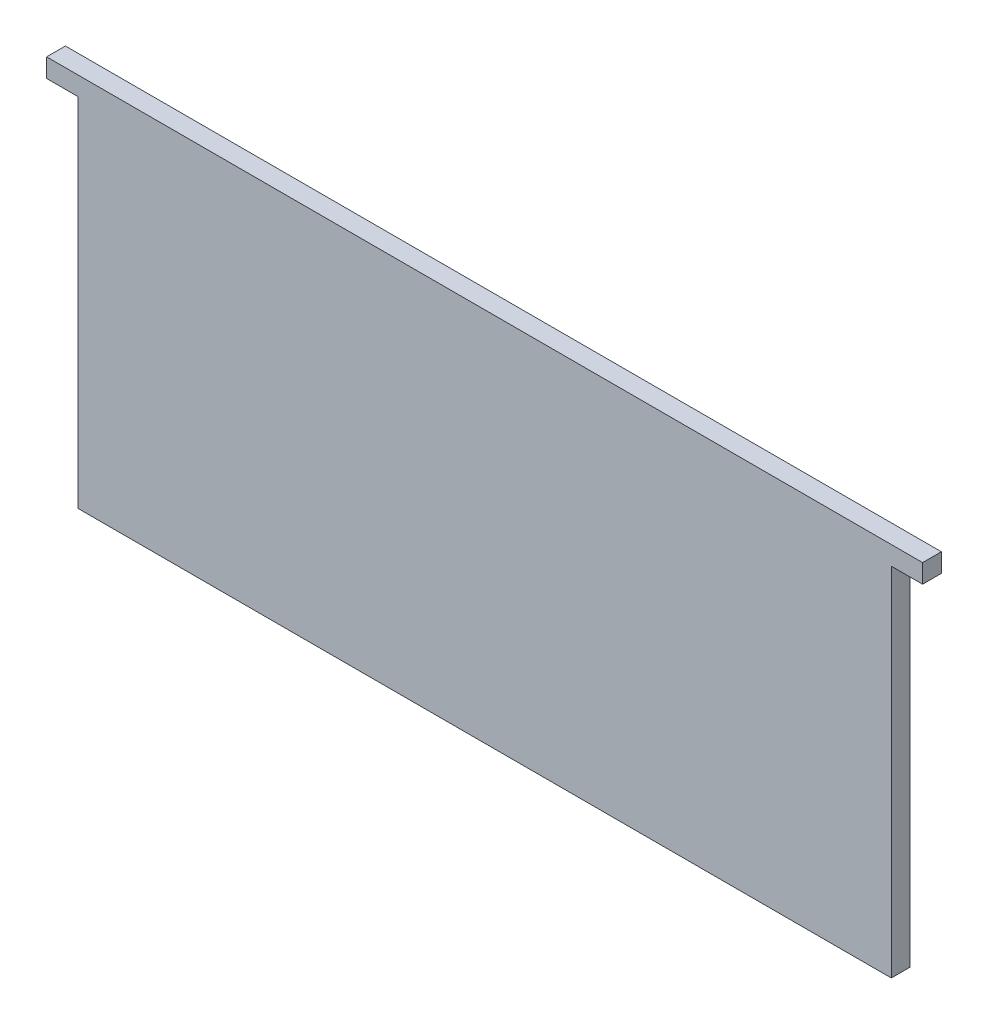
ISO-10303-21;
HEADER;
FILE_DESCRIPTION(('STEP AP214'),'2;1');
FILE_NAME('part.step','',(''),(''),'','','');
FILE_SCHEMA(('AUTOMOTIVE_DESIGN { 1 0 10303 214 1 1 1 1 }'));
ENDSEC;
DATA;
#1=APPLICATION_CONTEXT('core data for automotive mechanical design processes');
#2=APPLICATION_PROTOCOL_DEFINITION('international standard','automotive_design',2000,#1);
#3=PRODUCT_CONTEXT('',#1,'mechanical');
#4=PRODUCT('Part','Part','',(#3));
#5=PRODUCT_RELATED_PRODUCT_CATEGORY('part','',(#4));
#6=PRODUCT_DEFINITION_FORMATION('','',#4);
#7=PRODUCT_DEFINITION_CONTEXT('part definition',#1,'design');
#8=PRODUCT_DEFINITION('design','',#6,#7);
#9=PRODUCT_DEFINITION_SHAPE('','',#8);
#10=(LENGTH_UNIT() NAMED_UNIT(*) SI_UNIT(.MILLI.,.METRE.));
#11=(NAMED_UNIT(*) PLANE_ANGLE_UNIT() SI_UNIT($,.RADIAN.));
#12=(NAMED_UNIT(*) SI_UNIT($,.STERADIAN.) SOLID_ANGLE_UNIT());
#13=UNCERTAINTY_MEASURE_WITH_UNIT(LENGTH_MEASURE(1.E-05),#10,'distance_accuracy_value','');
#14=(GEOMETRIC_REPRESENTATION_CONTEXT(3) GLOBAL_UNCERTAINTY_ASSIGNED_CONTEXT((#13)) GLOBAL_UNIT_ASSIGNED_CONTEXT((#10,
#11,#12)) REPRESENTATION_CONTEXT('',''));
#15=CARTESIAN_POINT('',(0.,0.,0.));
#16=DIRECTION('',(0.,0.,1.));
#17=DIRECTION('',(1.,0.,0.));
#18=AXIS2_PLACEMENT_3D('',#15,#16,#17);
#19=CARTESIAN_POINT('',(-65.,0.,3.));
#20=DIRECTION('',(-1.,0.,0.));
#21=DIRECTION('',(0.,0.,1.));
#22=AXIS2_PLACEMENT_3D('',#19,#20,#21);
#23=PLANE('',#22);
#24=DIRECTION('',(0.,1.,0.));
#25=VECTOR('',#24,1.);
#26=CARTESIAN_POINT('',(-65.,0.,0.));
#27=LINE('',#26,#25);
#28=CARTESIAN_POINT('',(-65.,-30.,0.));
#29=VERTEX_POINT('',#28);
#30=CARTESIAN_POINT('',(-65.,27.,0.));
#31=VERTEX_POINT('',#30);
#32=EDGE_CURVE('E130',#29,#31,#27,.T.);
#33=ORIENTED_EDGE('',*,*,#32,.F.);
#34=DIRECTION('',(0.,0.,-1.));
#35=VECTOR('',#34,1.);
#36=CARTESIAN_POINT('',(-65.,-30.,3.));
#37=LINE('',#36,#35);
#38=CARTESIAN_POINT('',(-65.,-30.,3.));
#39=VERTEX_POINT('',#38);
#40=EDGE_CURVE('E11',#39,#29,#37,.T.);
#41=ORIENTED_EDGE('',*,*,#40,.F.);
#42=DIRECTION('',(0.,1.,0.));
#43=VECTOR('',#42,1.);
#44=CARTESIAN_POINT('',(-65.,0.,3.));
#45=LINE('',#44,#43);
#46=CARTESIAN_POINT('',(-65.,27.,3.));
#47=VERTEX_POINT('',#46);
#48=EDGE_CURVE('E149',#39,#47,#45,.T.);
#49=ORIENTED_EDGE('',*,*,#48,.T.);
#50=DIRECTION('',(0.,0.,-1.));
#51=VECTOR('',#50,1.);
#52=CARTESIAN_POINT('',(-65.,27.,3.));
#53=LINE('',#52,#51);
#54=EDGE_CURVE('E89',#47,#31,#53,.T.);
#55=ORIENTED_EDGE('',*,*,#54,.T.);
#56=EDGE_LOOP('',(#33,#41,#49,#55));
#57=FACE_BOUND('',#56,.T.);
#58=ADVANCED_FACE('F38',(#57),#23,.T.);
#59=CARTESIAN_POINT('',(0.,-30.,3.));
#60=DIRECTION('',(0.,-1.,0.));
#61=DIRECTION('',(1.,0.,0.));
#62=AXIS2_PLACEMENT_3D('',#59,#60,#61);
#63=PLANE('',#62);
#64=DIRECTION('',(-1.,0.,0.));
#65=VECTOR('',#64,1.);
#66=CARTESIAN_POINT('',(0.,-30.,0.));
#67=LINE('',#66,#65);
#68=CARTESIAN_POINT('',(65.,-30.,0.));
#69=VERTEX_POINT('',#68);
#70=EDGE_CURVE('E133',#69,#29,#67,.T.);
#71=ORIENTED_EDGE('',*,*,#70,.F.);
#72=DIRECTION('',(0.,0.,-1.));
#73=VECTOR('',#72,1.);
#74=CARTESIAN_POINT('',(65.,-30.,3.));
#75=LINE('',#74,#73);
#76=CARTESIAN_POINT('',(65.,-30.,3.));
#77=VERTEX_POINT('',#76);
#78=EDGE_CURVE('E46',#77,#69,#75,.T.);
#79=ORIENTED_EDGE('',*,*,#78,.F.);
#80=DIRECTION('',(-1.,0.,0.));
#81=VECTOR('',#80,1.);
#82=CARTESIAN_POINT('',(0.,-30.,3.));
#83=LINE('',#82,#81);
#84=EDGE_CURVE('E170',#77,#39,#83,.T.);
#85=ORIENTED_EDGE('',*,*,#84,.T.);
#86=ORIENTED_EDGE('',*,*,#40,.T.);
#87=EDGE_LOOP('',(#71,#79,#85,#86));
#88=FACE_BOUND('',#87,.T.);
#89=ADVANCED_FACE('F169',(#88),#63,.T.);
#90=CARTESIAN_POINT('',(65.,0.,3.));
#91=DIRECTION('',(-1.,0.,0.));
#92=DIRECTION('',(0.,0.,1.));
#93=AXIS2_PLACEMENT_3D('',#90,#91,#92);
#94=PLANE('',#93);
#95=DIRECTION('',(0.,1.,0.));
#96=VECTOR('',#95,1.);
#97=CARTESIAN_POINT('',(65.,0.,0.));
#98=LINE('',#97,#96);
#99=CARTESIAN_POINT('',(65.,27.,0.));
#100=VERTEX_POINT('',#99);
#101=EDGE_CURVE('E136',#69,#100,#98,.T.);
#102=ORIENTED_EDGE('',*,*,#101,.T.);
#103=DIRECTION('',(0.,0.,-1.));
#104=VECTOR('',#103,1.);
#105=CARTESIAN_POINT('',(65.,27.,3.));
#106=LINE('',#105,#104);
#107=CARTESIAN_POINT('',(65.,27.,3.));
#108=VERTEX_POINT('',#107);
#109=EDGE_CURVE('E155',#108,#100,#106,.T.);
#110=ORIENTED_EDGE('',*,*,#109,.F.);
#111=DIRECTION('',(0.,1.,0.));
#112=VECTOR('',#111,1.);
#113=CARTESIAN_POINT('',(65.,0.,3.));
#114=LINE('',#113,#112);
#115=EDGE_CURVE('E161',#77,#108,#114,.T.);
#116=ORIENTED_EDGE('',*,*,#115,.F.);
#117=ORIENTED_EDGE('',*,*,#78,.T.);
#118=EDGE_LOOP('',(#102,#110,#116,#117));
#119=FACE_BOUND('',#118,.T.);
#120=ADVANCED_FACE('F159',(#119),#94,.F.);
#121=CARTESIAN_POINT('',(0.,27.,3.));
#122=DIRECTION('',(0.,-1.,0.));
#123=DIRECTION('',(0.,0.,-1.));
#124=AXIS2_PLACEMENT_3D('',#121,#122,#123);
#125=PLANE('',#124);
#126=DIRECTION('',(-1.,0.,0.));
#127=VECTOR('',#126,1.);
#128=CARTESIAN_POINT('',(0.,27.,0.));
#129=LINE('',#128,#127);
#130=CARTESIAN_POINT('',(70.,27.,0.));
#131=VERTEX_POINT('',#130);
#132=EDGE_CURVE('E139',#131,#100,#129,.T.);
#133=ORIENTED_EDGE('',*,*,#132,.F.);
#134=DIRECTION('',(0.,0.,-1.));
#135=VECTOR('',#134,1.);
#136=CARTESIAN_POINT('',(70.,27.,3.));
#137=LINE('',#136,#135);
#138=CARTESIAN_POINT('',(70.,27.,3.));
#139=VERTEX_POINT('',#138);
#140=EDGE_CURVE('E153',#139,#131,#137,.T.);
#141=ORIENTED_EDGE('',*,*,#140,.F.);
#142=DIRECTION('',(-1.,0.,0.));
#143=VECTOR('',#142,1.);
#144=CARTESIAN_POINT('',(0.,27.,3.));
#145=LINE('',#144,#143);
#146=EDGE_CURVE('E178',#139,#108,#145,.T.);
#147=ORIENTED_EDGE('',*,*,#146,.T.);
#148=ORIENTED_EDGE('',*,*,#109,.T.);
#149=EDGE_LOOP('',(#133,#141,#147,#148));
#150=FACE_BOUND('',#149,.T.);
#151=ADVANCED_FACE('F184',(#150),#125,.T.);
#152=CARTESIAN_POINT('',(69.9999999999999,-3.23815048849004E-13,3.));
#153=DIRECTION('',(1.,0.,0.));
#154=DIRECTION('',(0.,1.,0.));
#155=AXIS2_PLACEMENT_3D('',#152,#153,#154);
#156=PLANE('',#155);
#157=DIRECTION('',(0.,-1.,0.));
#158=VECTOR('',#157,1.);
#159=CARTESIAN_POINT('',(69.9999999999999,-3.23815048849004E-13,0.));
#160=LINE('',#159,#158);
#161=CARTESIAN_POINT('',(70.,30.,0.));
#162=VERTEX_POINT('',#161);
#163=EDGE_CURVE('E142',#162,#131,#160,.T.);
#164=ORIENTED_EDGE('',*,*,#163,.F.);
#165=DIRECTION('',(0.,0.,-1.));
#166=VECTOR('',#165,1.);
#167=CARTESIAN_POINT('',(70.,30.,3.));
#168=LINE('',#167,#166);
#169=CARTESIAN_POINT('',(70.,30.,3.));
#170=VERTEX_POINT('',#169);
#171=EDGE_CURVE('E122',#170,#162,#168,.T.);
#172=ORIENTED_EDGE('',*,*,#171,.F.);
#173=DIRECTION('',(0.,-1.,0.));
#174=VECTOR('',#173,1.);
#175=CARTESIAN_POINT('',(69.9999999999999,-3.23815048849004E-13,3.));
#176=LINE('',#175,#174);
#177=EDGE_CURVE('E115',#170,#139,#176,.T.);
#178=ORIENTED_EDGE('',*,*,#177,.T.);
#179=ORIENTED_EDGE('',*,*,#140,.T.);
#180=EDGE_LOOP('',(#164,#172,#178,#179));
#181=FACE_BOUND('',#180,.T.);
#182=ADVANCED_FACE('F182',(#181),#156,.T.);
#183=CARTESIAN_POINT('',(0.,30.,3.));
#184=DIRECTION('',(0.,-1.,0.));
#185=DIRECTION('',(1.,0.,0.));
#186=AXIS2_PLACEMENT_3D('',#183,#184,#185);
#187=PLANE('',#186);
#188=DIRECTION('',(-1.,0.,0.));
#189=VECTOR('',#188,1.);
#190=CARTESIAN_POINT('',(0.,30.,0.));
#191=LINE('',#190,#189);
#192=CARTESIAN_POINT('',(-70.,30.,0.));
#193=VERTEX_POINT('',#192);
#194=EDGE_CURVE('E121',#162,#193,#191,.T.);
#195=ORIENTED_EDGE('',*,*,#194,.T.);
#196=DIRECTION('',(0.,0.,-1.));
#197=VECTOR('',#196,1.);
#198=CARTESIAN_POINT('',(-70.,30.,3.));
#199=LINE('',#198,#197);
#200=CARTESIAN_POINT('',(-70.,30.,3.));
#201=VERTEX_POINT('',#200);
#202=EDGE_CURVE('E118',#201,#193,#199,.T.);
#203=ORIENTED_EDGE('',*,*,#202,.F.);
#204=DIRECTION('',(-1.,0.,0.));
#205=VECTOR('',#204,1.);
#206=CARTESIAN_POINT('',(0.,30.,3.));
#207=LINE('',#206,#205);
#208=EDGE_CURVE('E108',#170,#201,#207,.T.);
#209=ORIENTED_EDGE('',*,*,#208,.F.);
#210=ORIENTED_EDGE('',*,*,#171,.T.);
#211=EDGE_LOOP('',(#195,#203,#209,#210));
#212=FACE_BOUND('',#211,.T.);
#213=ADVANCED_FACE('F119',(#212),#187,.F.);
#214=CARTESIAN_POINT('',(-70.0000000000001,3.23815048849005E-13,3.));
#215=DIRECTION('',(1.,0.,0.));
#216=DIRECTION('',(0.,1.,0.));
#217=AXIS2_PLACEMENT_3D('',#214,#215,#216);
#218=PLANE('',#217);
#219=DIRECTION('',(0.,-1.,0.));
#220=VECTOR('',#219,1.);
#221=CARTESIAN_POINT('',(-70.0000000000001,3.23815048849005E-13,0.));
#222=LINE('',#221,#220);
#223=CARTESIAN_POINT('',(-70.,27.,0.));
#224=VERTEX_POINT('',#223);
#225=EDGE_CURVE('E82',#193,#224,#222,.T.);
#226=ORIENTED_EDGE('',*,*,#225,.T.);
#227=DIRECTION('',(0.,0.,-1.));
#228=VECTOR('',#227,1.);
#229=CARTESIAN_POINT('',(-70.,27.,3.));
#230=LINE('',#229,#228);
#231=CARTESIAN_POINT('',(-70.,27.,3.));
#232=VERTEX_POINT('',#231);
#233=EDGE_CURVE('E123',#232,#224,#230,.T.);
#234=ORIENTED_EDGE('',*,*,#233,.F.);
#235=DIRECTION('',(0.,-1.,0.));
#236=VECTOR('',#235,1.);
#237=CARTESIAN_POINT('',(-70.0000000000001,3.23815048849005E-13,3.));
#238=LINE('',#237,#236);
#239=EDGE_CURVE('E112',#201,#232,#238,.T.);
#240=ORIENTED_EDGE('',*,*,#239,.F.);
#241=ORIENTED_EDGE('',*,*,#202,.T.);
#242=EDGE_LOOP('',(#226,#234,#240,#241));
#243=FACE_BOUND('',#242,.T.);
#244=ADVANCED_FACE('F125',(#243),#218,.F.);
#245=CARTESIAN_POINT('',(0.,27.,3.));
#246=DIRECTION('',(0.,1.,0.));
#247=DIRECTION('',(0.,0.,1.));
#248=AXIS2_PLACEMENT_3D('',#245,#246,#247);
#249=PLANE('',#248);
#250=DIRECTION('',(1.,0.,0.));
#251=VECTOR('',#250,1.);
#252=CARTESIAN_POINT('',(0.,27.,0.));
#253=LINE('',#252,#251);
#254=EDGE_CURVE('E147',#224,#31,#253,.T.);
#255=ORIENTED_EDGE('',*,*,#254,.T.);
#256=ORIENTED_EDGE('',*,*,#54,.F.);
#257=DIRECTION('',(1.,0.,0.));
#258=VECTOR('',#257,1.);
#259=CARTESIAN_POINT('',(0.,27.,3.));
#260=LINE('',#259,#258);
#261=EDGE_CURVE('E54',#232,#47,#260,.T.);
#262=ORIENTED_EDGE('',*,*,#261,.F.);
#263=ORIENTED_EDGE('',*,*,#233,.T.);
#264=EDGE_LOOP('',(#255,#256,#262,#263));
#265=FACE_BOUND('',#264,.T.);
#266=ADVANCED_FACE('F173',(#265),#249,.F.);
#267=CARTESIAN_POINT('',(0.,0.,3.));
#268=DIRECTION('',(0.,0.,1.));
#269=DIRECTION('',(1.,0.,0.));
#270=AXIS2_PLACEMENT_3D('',#267,#268,#269);
#271=PLANE('',#270);
#272=ORIENTED_EDGE('',*,*,#48,.F.);
#273=ORIENTED_EDGE('',*,*,#84,.F.);
#274=ORIENTED_EDGE('',*,*,#115,.T.);
#275=ORIENTED_EDGE('',*,*,#146,.F.);
#276=ORIENTED_EDGE('',*,*,#177,.F.);
#277=ORIENTED_EDGE('',*,*,#208,.T.);
#278=ORIENTED_EDGE('',*,*,#239,.T.);
#279=ORIENTED_EDGE('',*,*,#261,.T.);
#280=EDGE_LOOP('',(#272,#273,#274,#275,#276,#277,#278,#279));
#281=FACE_BOUND('',#280,.T.);
#282=ADVANCED_FACE('F110',(#281),#271,.T.);
#283=CARTESIAN_POINT('',(0.,0.,0.));
#284=DIRECTION('',(0.,0.,1.));
#285=DIRECTION('',(1.,0.,0.));
#286=AXIS2_PLACEMENT_3D('',#283,#284,#285);
#287=PLANE('',#286);
#288=ORIENTED_EDGE('',*,*,#32,.T.);
#289=ORIENTED_EDGE('',*,*,#254,.F.);
#290=ORIENTED_EDGE('',*,*,#225,.F.);
#291=ORIENTED_EDGE('',*,*,#194,.F.);
#292=ORIENTED_EDGE('',*,*,#163,.T.);
#293=ORIENTED_EDGE('',*,*,#132,.T.);
#294=ORIENTED_EDGE('',*,*,#101,.F.);
#295=ORIENTED_EDGE('',*,*,#70,.T.);
#296=EDGE_LOOP('',(#288,#289,#290,#291,#292,#293,#294,#295));
#297=FACE_BOUND('',#296,.T.);
#298=ADVANCED_FACE('F167',(#297),#287,.F.);
#299=CLOSED_SHELL('',(#58,#89,#120,#151,#182,#213,#244,#266,#282,#298));
#300=MANIFOLD_SOLID_BREP('B2',#299);
#301=ADVANCED_BREP_SHAPE_REPRESENTATION('',(#18,#300),#14);
#302=SHAPE_DEFINITION_REPRESENTATION(#9,#301);
ENDSEC;
END-ISO-10303-21;
